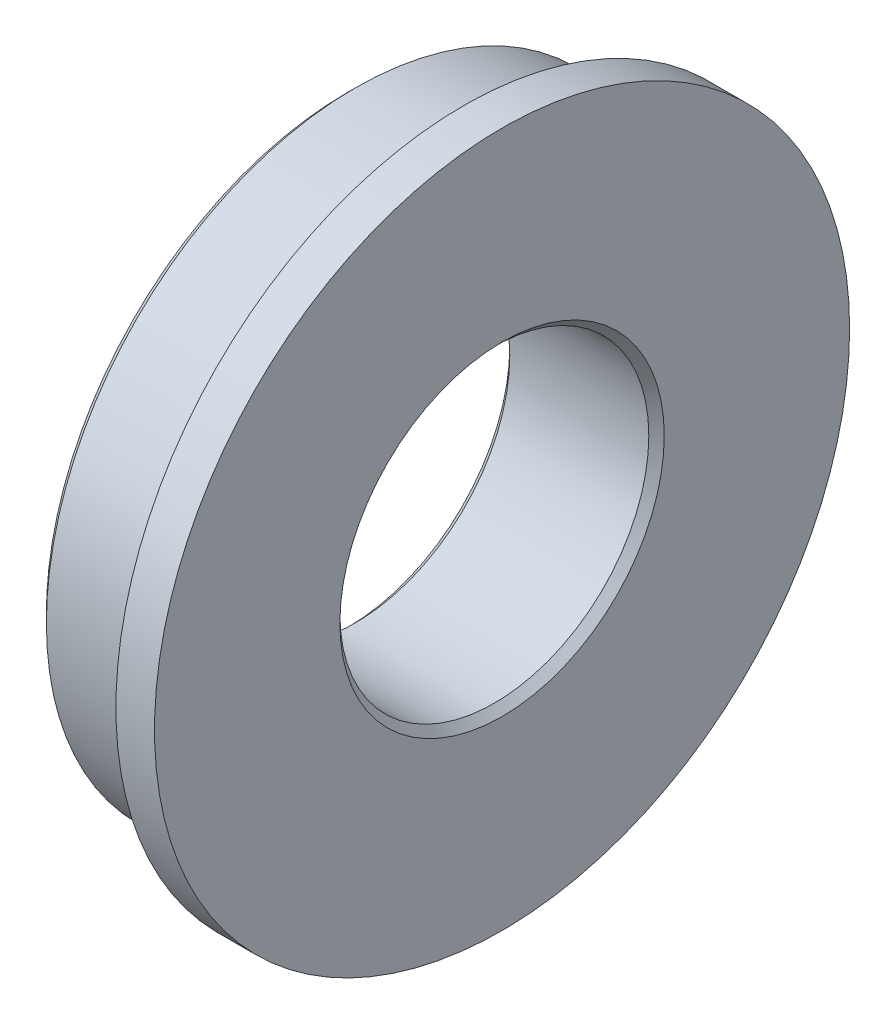
ISO-10303-21;
HEADER;
FILE_DESCRIPTION(('STEP AP214'),'2;1');
FILE_NAME('part.step','',(''),(''),'','','');
FILE_SCHEMA(('AUTOMOTIVE_DESIGN { 1 0 10303 214 1 1 1 1 }'));
ENDSEC;
DATA;
#1=APPLICATION_CONTEXT('core data for automotive mechanical design processes');
#2=APPLICATION_PROTOCOL_DEFINITION('international standard','automotive_design',2000,#1);
#3=PRODUCT_CONTEXT('',#1,'mechanical');
#4=PRODUCT('Part','Part','',(#3));
#5=PRODUCT_RELATED_PRODUCT_CATEGORY('part','',(#4));
#6=PRODUCT_DEFINITION_FORMATION('','',#4);
#7=PRODUCT_DEFINITION_CONTEXT('part definition',#1,'design');
#8=PRODUCT_DEFINITION('design','',#6,#7);
#9=PRODUCT_DEFINITION_SHAPE('','',#8);
#10=(LENGTH_UNIT() NAMED_UNIT(*) SI_UNIT(.MILLI.,.METRE.));
#11=(NAMED_UNIT(*) PLANE_ANGLE_UNIT() SI_UNIT($,.RADIAN.));
#12=(NAMED_UNIT(*) SI_UNIT($,.STERADIAN.) SOLID_ANGLE_UNIT());
#13=UNCERTAINTY_MEASURE_WITH_UNIT(LENGTH_MEASURE(1.E-05),#10,'distance_accuracy_value','');
#14=(GEOMETRIC_REPRESENTATION_CONTEXT(3) GLOBAL_UNCERTAINTY_ASSIGNED_CONTEXT((#13)) GLOBAL_UNIT_ASSIGNED_CONTEXT((#10,
#11,#12)) REPRESENTATION_CONTEXT('',''));
#15=CARTESIAN_POINT('',(0.,0.,0.));
#16=DIRECTION('',(0.,0.,1.));
#17=DIRECTION('',(1.,0.,0.));
#18=AXIS2_PLACEMENT_3D('',#15,#16,#17);
#19=CARTESIAN_POINT('',(0.,8.,0.));
#20=DIRECTION('',(1.,0.,0.));
#21=DIRECTION('',(0.,0.,-1.));
#22=AXIS2_PLACEMENT_3D('',#19,#20,#21);
#23=PLANE('',#22);
#24=CARTESIAN_POINT('',(0.,0.,0.));
#25=DIRECTION('',(1.,0.,0.));
#26=DIRECTION('',(0.,1.,0.));
#27=AXIS2_PLACEMENT_3D('',#24,#25,#26);
#28=CIRCLE('',#27,7.79999999999999);
#29=CARTESIAN_POINT('',(0.,7.79999999999999,0.));
#30=VERTEX_POINT('',#29);
#31=EDGE_CURVE('E17',#30,#30,#28,.T.);
#32=ORIENTED_EDGE('',*,*,#31,.F.);
#33=EDGE_LOOP('',(#32));
#34=FACE_BOUND('',#33,.T.);
#35=CARTESIAN_POINT('',(0.,0.,0.));
#36=DIRECTION('',(-1.,0.,0.));
#37=DIRECTION('',(0.,0.,1.));
#38=AXIS2_PLACEMENT_3D('',#35,#36,#37);
#39=CIRCLE('',#38,4.1999999999689);
#40=CARTESIAN_POINT('',(0.,0.,4.1999999999689));
#41=VERTEX_POINT('',#40);
#42=EDGE_CURVE('E38',#41,#41,#39,.F.);
#43=ORIENTED_EDGE('',*,*,#42,.T.);
#44=EDGE_LOOP('',(#43));
#45=FACE_BOUND('',#44,.T.);
#46=ADVANCED_FACE('F14',(#34,#45),#23,.F.);
#47=CARTESIAN_POINT('',(0.200000000000007,0.,0.));
#48=DIRECTION('',(1.,0.,0.));
#49=DIRECTION('',(0.,1.,0.));
#50=AXIS2_PLACEMENT_3D('',#47,#48,#49);
#51=CONICAL_SURFACE('',#50,8.,0.785398163397447);
#52=ORIENTED_EDGE('',*,*,#31,.T.);
#53=EDGE_LOOP('',(#52));
#54=FACE_BOUND('',#53,.T.);
#55=CARTESIAN_POINT('',(0.200000000000006,0.,0.));
#56=DIRECTION('',(1.,0.,0.));
#57=DIRECTION('',(0.,0.,-1.));
#58=AXIS2_PLACEMENT_3D('',#55,#56,#57);
#59=CIRCLE('',#58,8.);
#60=CARTESIAN_POINT('',(0.200000000000006,0.,-8.));
#61=VERTEX_POINT('',#60);
#62=EDGE_CURVE('E29',#61,#61,#59,.T.);
#63=ORIENTED_EDGE('',*,*,#62,.F.);
#64=EDGE_LOOP('',(#63));
#65=FACE_BOUND('',#64,.T.);
#66=ADVANCED_FACE('F46',(#54,#65),#51,.T.);
#67=CARTESIAN_POINT('',(0.,0.,0.));
#68=DIRECTION('',(-1.,0.,0.));
#69=DIRECTION('',(0.,0.,1.));
#70=AXIS2_PLACEMENT_3D('',#67,#68,#69);
#71=CONICAL_SURFACE('',#70,4.1999999999689,0.785398163397448);
#72=ORIENTED_EDGE('',*,*,#42,.F.);
#73=EDGE_LOOP('',(#72));
#74=FACE_BOUND('',#73,.T.);
#75=CARTESIAN_POINT('',(0.200000000000002,0.,0.));
#76=DIRECTION('',(1.,0.,0.));
#77=DIRECTION('',(0.,0.,-1.));
#78=AXIS2_PLACEMENT_3D('',#75,#76,#77);
#79=CIRCLE('',#78,4.);
#80=CARTESIAN_POINT('',(0.200000000000002,0.,-4.));
#81=VERTEX_POINT('',#80);
#82=EDGE_CURVE('E37',#81,#81,#79,.T.);
#83=ORIENTED_EDGE('',*,*,#82,.T.);
#84=EDGE_LOOP('',(#83));
#85=FACE_BOUND('',#84,.T.);
#86=ADVANCED_FACE('F54',(#74,#85),#71,.F.);
#87=CARTESIAN_POINT('',(0.,0.,0.));
#88=DIRECTION('',(1.,0.,0.));
#89=DIRECTION('',(0.,0.,-1.));
#90=AXIS2_PLACEMENT_3D('',#87,#88,#89);
#91=CYLINDRICAL_SURFACE('',#90,8.);
#92=CARTESIAN_POINT('',(3.,0.,0.));
#93=DIRECTION('',(1.,0.,0.));
#94=DIRECTION('',(0.,0.,-1.));
#95=AXIS2_PLACEMENT_3D('',#92,#93,#94);
#96=CIRCLE('',#95,8.);
#97=CARTESIAN_POINT('',(3.,0.,-8.));
#98=VERTEX_POINT('',#97);
#99=EDGE_CURVE('E35',#98,#98,#96,.F.);
#100=ORIENTED_EDGE('',*,*,#99,.T.);
#101=EDGE_LOOP('',(#100));
#102=FACE_BOUND('',#101,.T.);
#103=ORIENTED_EDGE('',*,*,#62,.T.);
#104=EDGE_LOOP('',(#103));
#105=FACE_BOUND('',#104,.T.);
#106=ADVANCED_FACE('F77',(#102,#105),#91,.T.);
#107=CARTESIAN_POINT('',(0.,0.,0.));
#108=DIRECTION('',(1.,0.,0.));
#109=DIRECTION('',(0.,0.,-1.));
#110=AXIS2_PLACEMENT_3D('',#107,#108,#109);
#111=CYLINDRICAL_SURFACE('',#110,4.);
#112=ORIENTED_EDGE('',*,*,#82,.F.);
#113=EDGE_LOOP('',(#112));
#114=FACE_BOUND('',#113,.T.);
#115=CARTESIAN_POINT('',(3.80000000001246,0.,0.));
#116=DIRECTION('',(1.,0.,0.));
#117=DIRECTION('',(0.,0.,-1.));
#118=AXIS2_PLACEMENT_3D('',#115,#116,#117);
#119=CIRCLE('',#118,3.99999999996226);
#120=CARTESIAN_POINT('',(3.80000000001246,0.,-3.99999999996226));
#121=VERTEX_POINT('',#120);
#122=EDGE_CURVE('E34',#121,#121,#119,.T.);
#123=ORIENTED_EDGE('',*,*,#122,.T.);
#124=EDGE_LOOP('',(#123));
#125=FACE_BOUND('',#124,.T.);
#126=ADVANCED_FACE('F73',(#114,#125),#111,.F.);
#127=CARTESIAN_POINT('',(3.,8.,0.));
#128=DIRECTION('',(1.,0.,0.));
#129=DIRECTION('',(0.,0.,-1.));
#130=AXIS2_PLACEMENT_3D('',#127,#128,#129);
#131=PLANE('',#130);
#132=CARTESIAN_POINT('',(3.,0.,0.));
#133=DIRECTION('',(1.,0.,0.));
#134=DIRECTION('',(0.,0.,-1.));
#135=AXIS2_PLACEMENT_3D('',#132,#133,#134);
#136=CIRCLE('',#135,9.);
#137=CARTESIAN_POINT('',(3.,0.,-9.));
#138=VERTEX_POINT('',#137);
#139=EDGE_CURVE('E26',#138,#138,#136,.T.);
#140=ORIENTED_EDGE('',*,*,#139,.F.);
#141=EDGE_LOOP('',(#140));
#142=FACE_BOUND('',#141,.T.);
#143=ORIENTED_EDGE('',*,*,#99,.F.);
#144=EDGE_LOOP('',(#143));
#145=FACE_BOUND('',#144,.T.);
#146=ADVANCED_FACE('F69',(#142,#145),#131,.F.);
#147=CARTESIAN_POINT('',(4.00000000007594,0.,0.));
#148=DIRECTION('',(1.,0.,0.));
#149=DIRECTION('',(0.,0.,-1.));
#150=AXIS2_PLACEMENT_3D('',#147,#148,#149);
#151=CONICAL_SURFACE('',#150,4.20000000002574,0.785398163397448);
#152=CARTESIAN_POINT('',(4.00000000007594,0.,0.));
#153=DIRECTION('',(1.,0.,0.));
#154=DIRECTION('',(0.,0.,-1.));
#155=AXIS2_PLACEMENT_3D('',#152,#153,#154);
#156=CIRCLE('',#155,4.20000000002574);
#157=CARTESIAN_POINT('',(4.00000000007594,0.,-4.20000000002574));
#158=VERTEX_POINT('',#157);
#159=EDGE_CURVE('E21',#158,#158,#156,.T.);
#160=ORIENTED_EDGE('',*,*,#159,.T.);
#161=EDGE_LOOP('',(#160));
#162=FACE_BOUND('',#161,.T.);
#163=ORIENTED_EDGE('',*,*,#122,.F.);
#164=EDGE_LOOP('',(#163));
#165=FACE_BOUND('',#164,.T.);
#166=ADVANCED_FACE('F63',(#162,#165),#151,.F.);
#167=CARTESIAN_POINT('',(0.,0.,0.));
#168=DIRECTION('',(1.,0.,0.));
#169=DIRECTION('',(0.,0.,-1.));
#170=AXIS2_PLACEMENT_3D('',#167,#168,#169);
#171=CYLINDRICAL_SURFACE('',#170,9.);
#172=CARTESIAN_POINT('',(4.,0.,0.));
#173=DIRECTION('',(1.,0.,0.));
#174=DIRECTION('',(0.,0.,-1.));
#175=AXIS2_PLACEMENT_3D('',#172,#173,#174);
#176=CIRCLE('',#175,9.);
#177=CARTESIAN_POINT('',(4.,0.,-9.));
#178=VERTEX_POINT('',#177);
#179=EDGE_CURVE('E10',#178,#178,#176,.F.);
#180=ORIENTED_EDGE('',*,*,#179,.T.);
#181=EDGE_LOOP('',(#180));
#182=FACE_BOUND('',#181,.T.);
#183=ORIENTED_EDGE('',*,*,#139,.T.);
#184=EDGE_LOOP('',(#183));
#185=FACE_BOUND('',#184,.T.);
#186=ADVANCED_FACE('F57',(#182,#185),#171,.T.);
#187=CARTESIAN_POINT('',(4.,4.,0.));
#188=DIRECTION('',(-1.,0.,0.));
#189=DIRECTION('',(0.,0.,1.));
#190=AXIS2_PLACEMENT_3D('',#187,#188,#189);
#191=PLANE('',#190);
#192=ORIENTED_EDGE('',*,*,#179,.F.);
#193=EDGE_LOOP('',(#192));
#194=FACE_BOUND('',#193,.T.);
#195=ORIENTED_EDGE('',*,*,#159,.F.);
#196=EDGE_LOOP('',(#195));
#197=FACE_BOUND('',#196,.T.);
#198=ADVANCED_FACE('F55',(#194,#197),#191,.F.);
#199=CLOSED_SHELL('',(#46,#66,#86,#106,#126,#146,#166,#186,#198));
#200=MANIFOLD_SOLID_BREP('B1',#199);
#201=ADVANCED_BREP_SHAPE_REPRESENTATION('',(#18,#200),#14);
#202=SHAPE_DEFINITION_REPRESENTATION(#9,#201);
ENDSEC;
END-ISO-10303-21;
